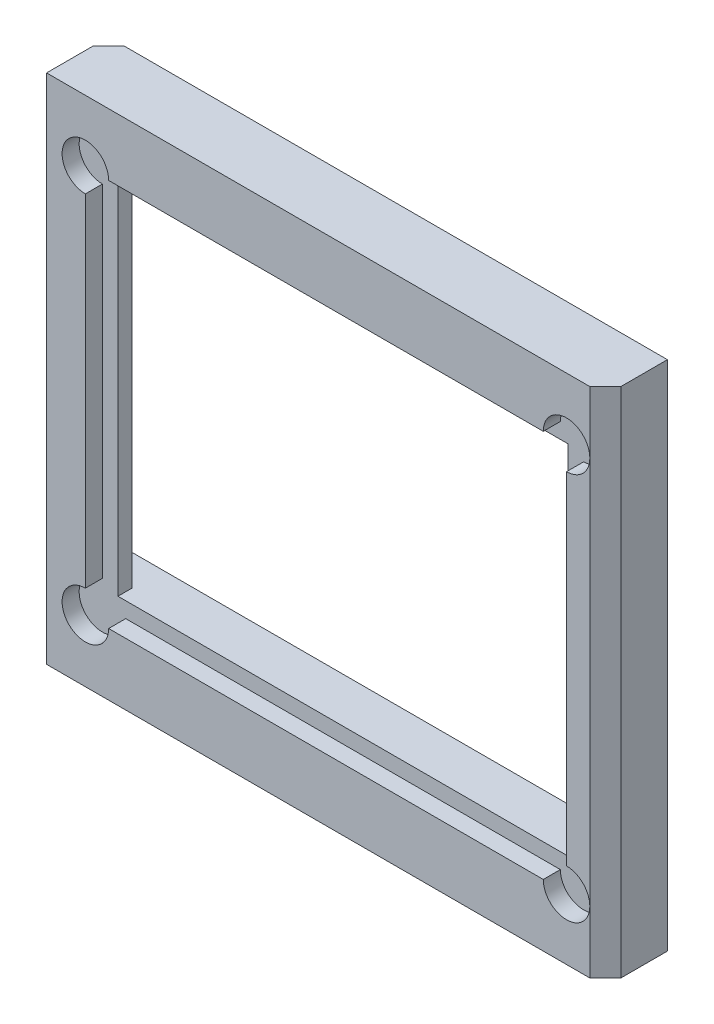
ISO-10303-21;
HEADER;
FILE_DESCRIPTION(('STEP AP214'),'2;1');
FILE_NAME('part.step','',(''),(''),'','','');
FILE_SCHEMA(('AUTOMOTIVE_DESIGN { 1 0 10303 214 1 1 1 1 }'));
ENDSEC;
DATA;
#1=APPLICATION_CONTEXT('core data for automotive mechanical design processes');
#2=APPLICATION_PROTOCOL_DEFINITION('international standard','automotive_design',2000,#1);
#3=PRODUCT_CONTEXT('',#1,'mechanical');
#4=PRODUCT('Part','Part','',(#3));
#5=PRODUCT_RELATED_PRODUCT_CATEGORY('part','',(#4));
#6=PRODUCT_DEFINITION_FORMATION('','',#4);
#7=PRODUCT_DEFINITION_CONTEXT('part definition',#1,'design');
#8=PRODUCT_DEFINITION('design','',#6,#7);
#9=PRODUCT_DEFINITION_SHAPE('','',#8);
#10=(LENGTH_UNIT() NAMED_UNIT(*) SI_UNIT(.MILLI.,.METRE.));
#11=(NAMED_UNIT(*) PLANE_ANGLE_UNIT() SI_UNIT($,.RADIAN.));
#12=(NAMED_UNIT(*) SI_UNIT($,.STERADIAN.) SOLID_ANGLE_UNIT());
#13=UNCERTAINTY_MEASURE_WITH_UNIT(LENGTH_MEASURE(1.E-05),#10,'distance_accuracy_value','');
#14=(GEOMETRIC_REPRESENTATION_CONTEXT(3) GLOBAL_UNCERTAINTY_ASSIGNED_CONTEXT((#13)) GLOBAL_UNIT_ASSIGNED_CONTEXT((#10,
#11,#12)) REPRESENTATION_CONTEXT('',''));
#15=CARTESIAN_POINT('',(0.,0.,0.));
#16=DIRECTION('',(0.,0.,1.));
#17=DIRECTION('',(1.,0.,0.));
#18=AXIS2_PLACEMENT_3D('',#15,#16,#17);
#19=CARTESIAN_POINT('',(0.,0.,4.));
#20=DIRECTION('',(0.,0.,-1.));
#21=DIRECTION('',(-1.,0.,0.));
#22=AXIS2_PLACEMENT_3D('',#19,#20,#21);
#23=PLANE('',#22);
#24=DIRECTION('',(1.,0.,0.));
#25=VECTOR('',#24,1.);
#26=CARTESIAN_POINT('',(-18.,-16.5,4.));
#27=LINE('',#26,#25);
#28=CARTESIAN_POINT('',(-18.,-16.5,4.));
#29=VERTEX_POINT('',#28);
#30=CARTESIAN_POINT('',(17.,-16.5,4.));
#31=VERTEX_POINT('',#30);
#32=EDGE_CURVE('E309',#29,#31,#27,.T.);
#33=ORIENTED_EDGE('',*,*,#32,.T.);
#34=DIRECTION('',(0.,1.,0.));
#35=VECTOR('',#34,1.);
#36=CARTESIAN_POINT('',(17.,0.,4.));
#37=LINE('',#36,#35);
#38=CARTESIAN_POINT('',(17.,-12.5,4.));
#39=VERTEX_POINT('',#38);
#40=EDGE_CURVE('E47',#31,#39,#37,.T.);
#41=ORIENTED_EDGE('',*,*,#40,.T.);
#42=CARTESIAN_POINT('',(15.5,-12.5,4.));
#43=DIRECTION('',(0.,0.,1.));
#44=DIRECTION('',(1.,0.,0.));
#45=AXIS2_PLACEMENT_3D('',#42,#43,#44);
#46=CIRCLE('',#45,1.49999999999999);
#47=CARTESIAN_POINT('',(14.,-12.5,4.));
#48=VERTEX_POINT('',#47);
#49=EDGE_CURVE('E263',#48,#39,#46,.T.);
#50=ORIENTED_EDGE('',*,*,#49,.F.);
#51=DIRECTION('',(1.,0.,0.));
#52=VECTOR('',#51,1.);
#53=CARTESIAN_POINT('',(-15.5,-12.5,4.));
#54=LINE('',#53,#52);
#55=CARTESIAN_POINT('',(-14.,-12.5,4.));
#56=VERTEX_POINT('',#55);
#57=EDGE_CURVE('E286',#56,#48,#54,.T.);
#58=ORIENTED_EDGE('',*,*,#57,.F.);
#59=CARTESIAN_POINT('',(-15.5,-12.5,4.));
#60=DIRECTION('',(0.,0.,1.));
#61=DIRECTION('',(1.,0.,0.));
#62=AXIS2_PLACEMENT_3D('',#59,#60,#61);
#63=CIRCLE('',#62,1.49999999999999);
#64=CARTESIAN_POINT('',(-15.5,-11.,4.));
#65=VERTEX_POINT('',#64);
#66=EDGE_CURVE('E274',#65,#56,#63,.T.);
#67=ORIENTED_EDGE('',*,*,#66,.F.);
#68=DIRECTION('',(0.,-1.,0.));
#69=VECTOR('',#68,1.);
#70=CARTESIAN_POINT('',(-15.5,-12.5,4.));
#71=LINE('',#70,#69);
#72=CARTESIAN_POINT('',(-15.5,11.,4.));
#73=VERTEX_POINT('',#72);
#74=EDGE_CURVE('E300',#73,#65,#71,.T.);
#75=ORIENTED_EDGE('',*,*,#74,.F.);
#76=CARTESIAN_POINT('',(-15.5,12.5,4.));
#77=DIRECTION('',(0.,0.,1.));
#78=DIRECTION('',(1.,0.,0.));
#79=AXIS2_PLACEMENT_3D('',#76,#77,#78);
#80=CIRCLE('',#79,1.49999999999999);
#81=CARTESIAN_POINT('',(-14.,12.5,4.));
#82=VERTEX_POINT('',#81);
#83=EDGE_CURVE('E235',#82,#73,#80,.T.);
#84=ORIENTED_EDGE('',*,*,#83,.F.);
#85=DIRECTION('',(-1.,0.,0.));
#86=VECTOR('',#85,1.);
#87=CARTESIAN_POINT('',(-15.5,12.5,4.));
#88=LINE('',#87,#86);
#89=CARTESIAN_POINT('',(14.,12.5,4.));
#90=VERTEX_POINT('',#89);
#91=EDGE_CURVE('E297',#90,#82,#88,.T.);
#92=ORIENTED_EDGE('',*,*,#91,.F.);
#93=CARTESIAN_POINT('',(15.5,12.5,4.));
#94=DIRECTION('',(0.,0.,1.));
#95=DIRECTION('',(1.,0.,0.));
#96=AXIS2_PLACEMENT_3D('',#93,#94,#95);
#97=CIRCLE('',#96,1.49999999999999);
#98=CARTESIAN_POINT('',(17.,12.5,4.));
#99=VERTEX_POINT('',#98);
#100=EDGE_CURVE('E250',#99,#90,#97,.T.);
#101=ORIENTED_EDGE('',*,*,#100,.F.);
#102=DIRECTION('',(0.,1.,0.));
#103=VECTOR('',#102,1.);
#104=CARTESIAN_POINT('',(17.,0.,4.));
#105=LINE('',#104,#103);
#106=CARTESIAN_POINT('',(17.,16.5,4.));
#107=VERTEX_POINT('',#106);
#108=EDGE_CURVE('E365',#99,#107,#105,.T.);
#109=ORIENTED_EDGE('',*,*,#108,.T.);
#110=DIRECTION('',(-1.,0.,0.));
#111=VECTOR('',#110,1.);
#112=CARTESIAN_POINT('',(-18.,16.5,4.));
#113=LINE('',#112,#111);
#114=CARTESIAN_POINT('',(-18.,16.5,4.));
#115=VERTEX_POINT('',#114);
#116=EDGE_CURVE('E304',#107,#115,#113,.T.);
#117=ORIENTED_EDGE('',*,*,#116,.T.);
#118=DIRECTION('',(0.,-1.,0.));
#119=VECTOR('',#118,1.);
#120=CARTESIAN_POINT('',(-18.,-16.5,4.));
#121=LINE('',#120,#119);
#122=EDGE_CURVE('E306',#115,#29,#121,.T.);
#123=ORIENTED_EDGE('',*,*,#122,.T.);
#124=EDGE_LOOP('',(#33,#41,#50,#58,#67,#75,#84,#92,#101,#109,#117,#123));
#125=FACE_BOUND('',#124,.T.);
#126=ADVANCED_FACE('F38',(#125),#23,.F.);
#127=CARTESIAN_POINT('',(0.,0.,2.9));
#128=DIRECTION('',(0.,0.,-1.));
#129=DIRECTION('',(-1.,0.,0.));
#130=AXIS2_PLACEMENT_3D('',#127,#128,#129);
#131=PLANE('',#130);
#132=DIRECTION('',(-1.,0.,0.));
#133=VECTOR('',#132,1.);
#134=CARTESIAN_POINT('',(-15.5,12.5,2.9));
#135=LINE('',#134,#133);
#136=CARTESIAN_POINT('',(14.,12.5,2.9));
#137=VERTEX_POINT('',#136);
#138=CARTESIAN_POINT('',(-14.,12.5,2.9));
#139=VERTEX_POINT('',#138);
#140=EDGE_CURVE('E285',#137,#139,#135,.T.);
#141=ORIENTED_EDGE('',*,*,#140,.T.);
#142=CARTESIAN_POINT('',(-15.5,12.5,2.9));
#143=DIRECTION('',(0.,0.,1.));
#144=DIRECTION('',(1.,0.,0.));
#145=AXIS2_PLACEMENT_3D('',#142,#143,#144);
#146=CIRCLE('',#145,1.5);
#147=CARTESIAN_POINT('',(-15.5,11.,2.9));
#148=VERTEX_POINT('',#147);
#149=EDGE_CURVE('E242',#139,#148,#146,.T.);
#150=ORIENTED_EDGE('',*,*,#149,.T.);
#151=DIRECTION('',(0.,-1.,0.));
#152=VECTOR('',#151,1.);
#153=CARTESIAN_POINT('',(-15.5,-12.5,2.9));
#154=LINE('',#153,#152);
#155=CARTESIAN_POINT('',(-15.5,-11.,2.9));
#156=VERTEX_POINT('',#155);
#157=EDGE_CURVE('E289',#148,#156,#154,.T.);
#158=ORIENTED_EDGE('',*,*,#157,.T.);
#159=CARTESIAN_POINT('',(-15.5,-12.5,2.9));
#160=DIRECTION('',(0.,0.,1.));
#161=DIRECTION('',(1.,0.,0.));
#162=AXIS2_PLACEMENT_3D('',#159,#160,#161);
#163=CIRCLE('',#162,1.5);
#164=CARTESIAN_POINT('',(-14.,-12.5,2.9));
#165=VERTEX_POINT('',#164);
#166=EDGE_CURVE('E276',#156,#165,#163,.T.);
#167=ORIENTED_EDGE('',*,*,#166,.T.);
#168=DIRECTION('',(1.,0.,0.));
#169=VECTOR('',#168,1.);
#170=CARTESIAN_POINT('',(-15.5,-12.5,2.9));
#171=LINE('',#170,#169);
#172=CARTESIAN_POINT('',(14.,-12.5,2.9));
#173=VERTEX_POINT('',#172);
#174=EDGE_CURVE('E291',#165,#173,#171,.T.);
#175=ORIENTED_EDGE('',*,*,#174,.T.);
#176=CARTESIAN_POINT('',(15.5,-12.5,2.9));
#177=DIRECTION('',(0.,0.,1.));
#178=DIRECTION('',(1.,0.,0.));
#179=AXIS2_PLACEMENT_3D('',#176,#177,#178);
#180=CIRCLE('',#179,1.5);
#181=CARTESIAN_POINT('',(15.5,-11.,2.9));
#182=VERTEX_POINT('',#181);
#183=EDGE_CURVE('E266',#173,#182,#180,.T.);
#184=ORIENTED_EDGE('',*,*,#183,.T.);
#185=DIRECTION('',(0.,1.,0.));
#186=VECTOR('',#185,1.);
#187=CARTESIAN_POINT('',(15.5,-12.5,2.9));
#188=LINE('',#187,#186);
#189=CARTESIAN_POINT('',(15.5,11.,2.9));
#190=VERTEX_POINT('',#189);
#191=EDGE_CURVE('E282',#182,#190,#188,.T.);
#192=ORIENTED_EDGE('',*,*,#191,.T.);
#193=CARTESIAN_POINT('',(15.5,12.5,2.9));
#194=DIRECTION('',(0.,0.,1.));
#195=DIRECTION('',(1.,0.,0.));
#196=AXIS2_PLACEMENT_3D('',#193,#194,#195);
#197=CIRCLE('',#196,1.5);
#198=EDGE_CURVE('E254',#190,#137,#197,.T.);
#199=ORIENTED_EDGE('',*,*,#198,.T.);
#200=EDGE_LOOP('',(#141,#150,#158,#167,#175,#184,#192,#199));
#201=FACE_BOUND('',#200,.T.);
#202=DIRECTION('',(0.,1.,0.));
#203=VECTOR('',#202,1.);
#204=CARTESIAN_POINT('',(14.5,-11.5,2.9));
#205=LINE('',#204,#203);
#206=CARTESIAN_POINT('',(14.5,-11.5,2.9));
#207=VERTEX_POINT('',#206);
#208=CARTESIAN_POINT('',(14.5,11.5,2.9));
#209=VERTEX_POINT('',#208);
#210=EDGE_CURVE('E216',#207,#209,#205,.T.);
#211=ORIENTED_EDGE('',*,*,#210,.F.);
#212=DIRECTION('',(1.,0.,0.));
#213=VECTOR('',#212,1.);
#214=CARTESIAN_POINT('',(-14.5,-11.5,2.9));
#215=LINE('',#214,#213);
#216=CARTESIAN_POINT('',(-14.5,-11.5,2.9));
#217=VERTEX_POINT('',#216);
#218=EDGE_CURVE('E220',#217,#207,#215,.T.);
#219=ORIENTED_EDGE('',*,*,#218,.F.);
#220=DIRECTION('',(0.,-1.,0.));
#221=VECTOR('',#220,1.);
#222=CARTESIAN_POINT('',(-14.5,-11.5,2.9));
#223=LINE('',#222,#221);
#224=CARTESIAN_POINT('',(-14.5,11.5,2.9));
#225=VERTEX_POINT('',#224);
#226=EDGE_CURVE('E228',#225,#217,#223,.T.);
#227=ORIENTED_EDGE('',*,*,#226,.F.);
#228=DIRECTION('',(-1.,0.,0.));
#229=VECTOR('',#228,1.);
#230=CARTESIAN_POINT('',(-14.5,11.5,2.9));
#231=LINE('',#230,#229);
#232=EDGE_CURVE('E225',#209,#225,#231,.T.);
#233=ORIENTED_EDGE('',*,*,#232,.F.);
#234=EDGE_LOOP('',(#211,#219,#227,#233));
#235=FACE_BOUND('',#234,.T.);
#236=ADVANCED_FACE('F381',(#201,#235),#131,.F.);
#237=CARTESIAN_POINT('',(15.5,-11.,4.));
#238=VERTEX_POINT('',#237);
#239=EDGE_CURVE('E262',#39,#238,#46,.T.);
#240=ORIENTED_EDGE('',*,*,#239,.F.);
#241=DIRECTION('',(0.,1.,0.));
#242=VECTOR('',#241,1.);
#243=CARTESIAN_POINT('',(17.,0.,4.));
#244=LINE('',#243,#242);
#245=EDGE_CURVE('E54',#39,#99,#244,.T.);
#246=ORIENTED_EDGE('',*,*,#245,.T.);
#247=CARTESIAN_POINT('',(15.5,11.,4.));
#248=VERTEX_POINT('',#247);
#249=EDGE_CURVE('E251',#248,#99,#97,.T.);
#250=ORIENTED_EDGE('',*,*,#249,.F.);
#251=DIRECTION('',(0.,1.,0.));
#252=VECTOR('',#251,1.);
#253=CARTESIAN_POINT('',(15.5,-12.5,4.));
#254=LINE('',#253,#252);
#255=EDGE_CURVE('E281',#238,#248,#254,.T.);
#256=ORIENTED_EDGE('',*,*,#255,.F.);
#257=EDGE_LOOP('',(#240,#246,#250,#256));
#258=FACE_BOUND('',#257,.T.);
#259=ADVANCED_FACE('F373',(#258),#23,.F.);
#260=CARTESIAN_POINT('',(18.,-16.5,4.));
#261=DIRECTION('',(-1.,0.,0.));
#262=DIRECTION('',(0.,0.,1.));
#263=AXIS2_PLACEMENT_3D('',#260,#261,#262);
#264=PLANE('',#263);
#265=DIRECTION('',(0.,0.,-1.));
#266=VECTOR('',#265,1.);
#267=CARTESIAN_POINT('',(18.,16.5,4.));
#268=LINE('',#267,#266);
#269=CARTESIAN_POINT('',(18.,16.5,3.));
#270=VERTEX_POINT('',#269);
#271=CARTESIAN_POINT('',(18.,16.5,0.));
#272=VERTEX_POINT('',#271);
#273=EDGE_CURVE('E327',#270,#272,#268,.T.);
#274=ORIENTED_EDGE('',*,*,#273,.F.);
#275=DIRECTION('',(0.,-1.,0.));
#276=VECTOR('',#275,1.);
#277=CARTESIAN_POINT('',(18.,-16.5,3.));
#278=LINE('',#277,#276);
#279=CARTESIAN_POINT('',(18.,-16.5,3.));
#280=VERTEX_POINT('',#279);
#281=EDGE_CURVE('E11',#270,#280,#278,.T.);
#282=ORIENTED_EDGE('',*,*,#281,.T.);
#283=DIRECTION('',(0.,0.,-1.));
#284=VECTOR('',#283,1.);
#285=CARTESIAN_POINT('',(18.,-16.5,4.));
#286=LINE('',#285,#284);
#287=CARTESIAN_POINT('',(18.,-16.5,0.));
#288=VERTEX_POINT('',#287);
#289=EDGE_CURVE('E312',#280,#288,#286,.T.);
#290=ORIENTED_EDGE('',*,*,#289,.T.);
#291=DIRECTION('',(0.,1.,0.));
#292=VECTOR('',#291,1.);
#293=CARTESIAN_POINT('',(18.,-16.5,0.));
#294=LINE('',#293,#292);
#295=EDGE_CURVE('E294',#288,#272,#294,.T.);
#296=ORIENTED_EDGE('',*,*,#295,.T.);
#297=EDGE_LOOP('',(#274,#282,#290,#296));
#298=FACE_BOUND('',#297,.T.);
#299=ADVANCED_FACE('F414',(#298),#264,.F.);
#300=CARTESIAN_POINT('',(-18.,16.5,4.));
#301=DIRECTION('',(0.,-1.,0.));
#302=DIRECTION('',(0.,0.,-1.));
#303=AXIS2_PLACEMENT_3D('',#300,#301,#302);
#304=PLANE('',#303);
#305=DIRECTION('',(-1.,0.,0.));
#306=VECTOR('',#305,1.);
#307=CARTESIAN_POINT('',(-18.,16.5,0.));
#308=LINE('',#307,#306);
#309=CARTESIAN_POINT('',(-17.,16.5,0.));
#310=VERTEX_POINT('',#309);
#311=EDGE_CURVE('E315',#272,#310,#308,.T.);
#312=ORIENTED_EDGE('',*,*,#311,.T.);
#313=DIRECTION('',(-0.70710678118655,0.,0.707106781186545));
#314=VECTOR('',#313,1.);
#315=CARTESIAN_POINT('',(-18.,16.5,1.));
#316=LINE('',#315,#314);
#317=CARTESIAN_POINT('',(-18.,16.5,1.));
#318=VERTEX_POINT('',#317);
#319=EDGE_CURVE('E363',#310,#318,#316,.T.);
#320=ORIENTED_EDGE('',*,*,#319,.T.);
#321=DIRECTION('',(0.,0.,-1.));
#322=VECTOR('',#321,1.);
#323=CARTESIAN_POINT('',(-18.,16.5,4.));
#324=LINE('',#323,#322);
#325=EDGE_CURVE('E324',#115,#318,#324,.T.);
#326=ORIENTED_EDGE('',*,*,#325,.F.);
#327=ORIENTED_EDGE('',*,*,#116,.F.);
#328=DIRECTION('',(-0.707106781186545,0.,0.70710678118655));
#329=VECTOR('',#328,1.);
#330=CARTESIAN_POINT('',(17.,16.5,4.));
#331=LINE('',#330,#329);
#332=EDGE_CURVE('E361',#107,#270,#331,.F.);
#333=ORIENTED_EDGE('',*,*,#332,.T.);
#334=ORIENTED_EDGE('',*,*,#273,.T.);
#335=EDGE_LOOP('',(#312,#320,#326,#327,#333,#334));
#336=FACE_BOUND('',#335,.T.);
#337=ADVANCED_FACE('F410',(#336),#304,.F.);
#338=CARTESIAN_POINT('',(-18.,-16.5,4.));
#339=DIRECTION('',(1.,0.,0.));
#340=DIRECTION('',(0.,0.,-1.));
#341=AXIS2_PLACEMENT_3D('',#338,#339,#340);
#342=PLANE('',#341);
#343=ORIENTED_EDGE('',*,*,#325,.T.);
#344=DIRECTION('',(0.,-1.,0.));
#345=VECTOR('',#344,1.);
#346=CARTESIAN_POINT('',(-18.,-16.5,1.));
#347=LINE('',#346,#345);
#348=CARTESIAN_POINT('',(-18.,-16.5,1.));
#349=VERTEX_POINT('',#348);
#350=EDGE_CURVE('E352',#318,#349,#347,.T.);
#351=ORIENTED_EDGE('',*,*,#350,.T.);
#352=DIRECTION('',(0.,0.,-1.));
#353=VECTOR('',#352,1.);
#354=CARTESIAN_POINT('',(-18.,-16.5,4.));
#355=LINE('',#354,#353);
#356=EDGE_CURVE('E321',#29,#349,#355,.T.);
#357=ORIENTED_EDGE('',*,*,#356,.F.);
#358=ORIENTED_EDGE('',*,*,#122,.F.);
#359=EDGE_LOOP('',(#343,#351,#357,#358));
#360=FACE_BOUND('',#359,.T.);
#361=ADVANCED_FACE('F427',(#360),#342,.F.);
#362=CARTESIAN_POINT('',(-18.,-16.5,4.));
#363=DIRECTION('',(0.,1.,0.));
#364=DIRECTION('',(0.,0.,1.));
#365=AXIS2_PLACEMENT_3D('',#362,#363,#364);
#366=PLANE('',#365);
#367=CARTESIAN_POINT('',(0.,-16.5,1.95141063670081));
#368=DIRECTION('',(0.,-1.,0.));
#369=DIRECTION('',(0.,0.,-1.));
#370=AXIS2_PLACEMENT_3D('',#367,#368,#369);
#371=CIRCLE('',#370,1.025);
#372=CARTESIAN_POINT('',(0.,-16.5,0.926410636700812));
#373=VERTEX_POINT('',#372);
#374=EDGE_CURVE('E200',#373,#373,#371,.T.);
#375=ORIENTED_EDGE('',*,*,#374,.F.);
#376=EDGE_LOOP('',(#375));
#377=FACE_BOUND('',#376,.T.);
#378=CARTESIAN_POINT('',(-12.5,-16.5,2.));
#379=DIRECTION('',(0.,-1.,0.));
#380=DIRECTION('',(0.,0.,-1.));
#381=AXIS2_PLACEMENT_3D('',#378,#379,#380);
#382=CIRCLE('',#381,1.49999999999999);
#383=CARTESIAN_POINT('',(-12.5,-16.5,0.500000000000011));
#384=VERTEX_POINT('',#383);
#385=EDGE_CURVE('E199',#384,#384,#382,.T.);
#386=ORIENTED_EDGE('',*,*,#385,.F.);
#387=EDGE_LOOP('',(#386));
#388=FACE_BOUND('',#387,.T.);
#389=CARTESIAN_POINT('',(12.5,-16.5,2.));
#390=DIRECTION('',(0.,-1.,0.));
#391=DIRECTION('',(0.,0.,-1.));
#392=AXIS2_PLACEMENT_3D('',#389,#390,#391);
#393=CIRCLE('',#392,1.49999999999999);
#394=CARTESIAN_POINT('',(12.5,-16.5,0.500000000000011));
#395=VERTEX_POINT('',#394);
#396=EDGE_CURVE('E210',#395,#395,#393,.T.);
#397=ORIENTED_EDGE('',*,*,#396,.F.);
#398=EDGE_LOOP('',(#397));
#399=FACE_BOUND('',#398,.T.);
#400=ORIENTED_EDGE('',*,*,#356,.T.);
#401=DIRECTION('',(0.70710678118655,0.,-0.707106781186545));
#402=VECTOR('',#401,1.);
#403=CARTESIAN_POINT('',(-18.,-16.5,1.));
#404=LINE('',#403,#402);
#405=CARTESIAN_POINT('',(-17.,-16.5,0.));
#406=VERTEX_POINT('',#405);
#407=EDGE_CURVE('E357',#349,#406,#404,.T.);
#408=ORIENTED_EDGE('',*,*,#407,.T.);
#409=DIRECTION('',(1.,0.,0.));
#410=VECTOR('',#409,1.);
#411=CARTESIAN_POINT('',(-18.,-16.5,0.));
#412=LINE('',#411,#410);
#413=EDGE_CURVE('E307',#406,#288,#412,.T.);
#414=ORIENTED_EDGE('',*,*,#413,.T.);
#415=ORIENTED_EDGE('',*,*,#289,.F.);
#416=DIRECTION('',(0.707106781186545,0.,-0.70710678118655));
#417=VECTOR('',#416,1.);
#418=CARTESIAN_POINT('',(17.,-16.5,4.));
#419=LINE('',#418,#417);
#420=EDGE_CURVE('E355',#280,#31,#419,.F.);
#421=ORIENTED_EDGE('',*,*,#420,.T.);
#422=ORIENTED_EDGE('',*,*,#32,.F.);
#423=EDGE_LOOP('',(#400,#408,#414,#415,#421,#422));
#424=FACE_BOUND('',#423,.T.);
#425=ADVANCED_FACE('F430',(#377,#388,#399,#424),#366,.F.);
#426=CARTESIAN_POINT('',(0.,0.,0.));
#427=DIRECTION('',(0.,0.,-1.));
#428=DIRECTION('',(-1.,0.,0.));
#429=AXIS2_PLACEMENT_3D('',#426,#427,#428);
#430=PLANE('',#429);
#431=DIRECTION('',(0.,-1.,0.));
#432=VECTOR('',#431,1.);
#433=CARTESIAN_POINT('',(-16.5,-11.5,0.));
#434=LINE('',#433,#432);
#435=CARTESIAN_POINT('',(-16.5,11.5,0.));
#436=VERTEX_POINT('',#435);
#437=CARTESIAN_POINT('',(-16.5,-11.5,0.));
#438=VERTEX_POINT('',#437);
#439=EDGE_CURVE('E335',#436,#438,#434,.T.);
#440=ORIENTED_EDGE('',*,*,#439,.T.);
#441=DIRECTION('',(1.,0.,0.));
#442=VECTOR('',#441,1.);
#443=CARTESIAN_POINT('',(-14.5,-11.5,0.));
#444=LINE('',#443,#442);
#445=CARTESIAN_POINT('',(16.5,-11.5,0.));
#446=VERTEX_POINT('',#445);
#447=EDGE_CURVE('E219',#438,#446,#444,.T.);
#448=ORIENTED_EDGE('',*,*,#447,.T.);
#449=DIRECTION('',(0.,1.,0.));
#450=VECTOR('',#449,1.);
#451=CARTESIAN_POINT('',(16.5,11.5,0.));
#452=LINE('',#451,#450);
#453=CARTESIAN_POINT('',(16.5,11.5,0.));
#454=VERTEX_POINT('',#453);
#455=EDGE_CURVE('E332',#446,#454,#452,.T.);
#456=ORIENTED_EDGE('',*,*,#455,.T.);
#457=DIRECTION('',(-1.,0.,0.));
#458=VECTOR('',#457,1.);
#459=CARTESIAN_POINT('',(-14.5,11.5,0.));
#460=LINE('',#459,#458);
#461=EDGE_CURVE('E217',#454,#436,#460,.T.);
#462=ORIENTED_EDGE('',*,*,#461,.T.);
#463=EDGE_LOOP('',(#440,#448,#456,#462));
#464=FACE_BOUND('',#463,.T.);
#465=ORIENTED_EDGE('',*,*,#413,.F.);
#466=DIRECTION('',(0.,1.,0.));
#467=VECTOR('',#466,1.);
#468=CARTESIAN_POINT('',(-17.,16.5,0.));
#469=LINE('',#468,#467);
#470=EDGE_CURVE('E359',#406,#310,#469,.T.);
#471=ORIENTED_EDGE('',*,*,#470,.T.);
#472=ORIENTED_EDGE('',*,*,#311,.F.);
#473=ORIENTED_EDGE('',*,*,#295,.F.);
#474=EDGE_LOOP('',(#465,#471,#472,#473));
#475=FACE_BOUND('',#474,.T.);
#476=ADVANCED_FACE('F419',(#464,#475),#430,.T.);
#477=CARTESIAN_POINT('',(15.5,-12.5,2.9));
#478=DIRECTION('',(1.,0.,0.));
#479=DIRECTION('',(0.,0.,-1.));
#480=AXIS2_PLACEMENT_3D('',#477,#478,#479);
#481=PLANE('',#480);
#482=ORIENTED_EDGE('',*,*,#255,.T.);
#483=DIRECTION('',(0.,0.,1.));
#484=VECTOR('',#483,1.);
#485=CARTESIAN_POINT('',(15.5,11.,4.));
#486=LINE('',#485,#484);
#487=EDGE_CURVE('E259',#248,#190,#486,.F.);
#488=ORIENTED_EDGE('',*,*,#487,.T.);
#489=ORIENTED_EDGE('',*,*,#191,.F.);
#490=DIRECTION('',(0.,0.,1.));
#491=VECTOR('',#490,1.);
#492=CARTESIAN_POINT('',(15.5,-11.,4.));
#493=LINE('',#492,#491);
#494=EDGE_CURVE('E271',#182,#238,#493,.T.);
#495=ORIENTED_EDGE('',*,*,#494,.T.);
#496=EDGE_LOOP('',(#482,#488,#489,#495));
#497=FACE_BOUND('',#496,.T.);
#498=ADVANCED_FACE('F438',(#497),#481,.F.);
#499=CARTESIAN_POINT('',(-15.5,-12.5,2.9));
#500=DIRECTION('',(0.,-1.,0.));
#501=DIRECTION('',(0.,0.,-1.));
#502=AXIS2_PLACEMENT_3D('',#499,#500,#501);
#503=PLANE('',#502);
#504=ORIENTED_EDGE('',*,*,#57,.T.);
#505=DIRECTION('',(0.,0.,1.));
#506=VECTOR('',#505,1.);
#507=CARTESIAN_POINT('',(14.,-12.5,4.));
#508=LINE('',#507,#506);
#509=EDGE_CURVE('E268',#48,#173,#508,.F.);
#510=ORIENTED_EDGE('',*,*,#509,.T.);
#511=ORIENTED_EDGE('',*,*,#174,.F.);
#512=DIRECTION('',(0.,0.,1.));
#513=VECTOR('',#512,1.);
#514=CARTESIAN_POINT('',(-14.,-12.5,4.));
#515=LINE('',#514,#513);
#516=EDGE_CURVE('E329',#165,#56,#515,.T.);
#517=ORIENTED_EDGE('',*,*,#516,.T.);
#518=EDGE_LOOP('',(#504,#510,#511,#517));
#519=FACE_BOUND('',#518,.T.);
#520=ADVANCED_FACE('F379',(#519),#503,.F.);
#521=CARTESIAN_POINT('',(-15.5,-12.5,2.9));
#522=DIRECTION('',(-1.,0.,0.));
#523=DIRECTION('',(0.,0.,1.));
#524=AXIS2_PLACEMENT_3D('',#521,#522,#523);
#525=PLANE('',#524);
#526=ORIENTED_EDGE('',*,*,#157,.F.);
#527=DIRECTION('',(0.,0.,1.));
#528=VECTOR('',#527,1.);
#529=CARTESIAN_POINT('',(-15.5,11.,4.));
#530=LINE('',#529,#528);
#531=EDGE_CURVE('E244',#148,#73,#530,.T.);
#532=ORIENTED_EDGE('',*,*,#531,.T.);
#533=ORIENTED_EDGE('',*,*,#74,.T.);
#534=DIRECTION('',(0.,0.,1.));
#535=VECTOR('',#534,1.);
#536=CARTESIAN_POINT('',(-15.5,-11.,4.));
#537=LINE('',#536,#535);
#538=EDGE_CURVE('E278',#65,#156,#537,.F.);
#539=ORIENTED_EDGE('',*,*,#538,.T.);
#540=EDGE_LOOP('',(#526,#532,#533,#539));
#541=FACE_BOUND('',#540,.T.);
#542=ADVANCED_FACE('F394',(#541),#525,.F.);
#543=CARTESIAN_POINT('',(-15.5,12.5,2.9));
#544=DIRECTION('',(0.,1.,0.));
#545=DIRECTION('',(0.,0.,1.));
#546=AXIS2_PLACEMENT_3D('',#543,#544,#545);
#547=PLANE('',#546);
#548=ORIENTED_EDGE('',*,*,#91,.T.);
#549=DIRECTION('',(0.,0.,1.));
#550=VECTOR('',#549,1.);
#551=CARTESIAN_POINT('',(-14.,12.5,4.));
#552=LINE('',#551,#550);
#553=EDGE_CURVE('E247',#82,#139,#552,.F.);
#554=ORIENTED_EDGE('',*,*,#553,.T.);
#555=ORIENTED_EDGE('',*,*,#140,.F.);
#556=DIRECTION('',(0.,0.,1.));
#557=VECTOR('',#556,1.);
#558=CARTESIAN_POINT('',(14.,12.5,4.));
#559=LINE('',#558,#557);
#560=EDGE_CURVE('E256',#137,#90,#559,.T.);
#561=ORIENTED_EDGE('',*,*,#560,.T.);
#562=EDGE_LOOP('',(#548,#554,#555,#561));
#563=FACE_BOUND('',#562,.T.);
#564=ADVANCED_FACE('F400',(#563),#547,.F.);
#565=CARTESIAN_POINT('',(-15.5,-12.5,4.));
#566=DIRECTION('',(0.,0.,1.));
#567=DIRECTION('',(1.,0.,0.));
#568=AXIS2_PLACEMENT_3D('',#565,#566,#567);
#569=CYLINDRICAL_SURFACE('',#568,1.49999999999999);
#570=ORIENTED_EDGE('',*,*,#66,.T.);
#571=ORIENTED_EDGE('',*,*,#516,.F.);
#572=ORIENTED_EDGE('',*,*,#166,.F.);
#573=ORIENTED_EDGE('',*,*,#538,.F.);
#574=EDGE_LOOP('',(#570,#571,#572,#573));
#575=FACE_BOUND('',#574,.T.);
#576=ADVANCED_FACE('F388',(#575),#569,.F.);
#577=CARTESIAN_POINT('',(15.5,-12.5,4.));
#578=DIRECTION('',(0.,0.,1.));
#579=DIRECTION('',(1.,0.,0.));
#580=AXIS2_PLACEMENT_3D('',#577,#578,#579);
#581=CYLINDRICAL_SURFACE('',#580,1.49999999999999);
#582=ORIENTED_EDGE('',*,*,#183,.F.);
#583=ORIENTED_EDGE('',*,*,#509,.F.);
#584=ORIENTED_EDGE('',*,*,#49,.T.);
#585=ORIENTED_EDGE('',*,*,#239,.T.);
#586=ORIENTED_EDGE('',*,*,#494,.F.);
#587=EDGE_LOOP('',(#582,#583,#584,#585,#586));
#588=FACE_BOUND('',#587,.T.);
#589=ADVANCED_FACE('F376',(#588),#581,.F.);
#590=CARTESIAN_POINT('',(15.5,12.5,4.));
#591=DIRECTION('',(0.,0.,1.));
#592=DIRECTION('',(1.,0.,0.));
#593=AXIS2_PLACEMENT_3D('',#590,#591,#592);
#594=CYLINDRICAL_SURFACE('',#593,1.49999999999999);
#595=ORIENTED_EDGE('',*,*,#249,.T.);
#596=ORIENTED_EDGE('',*,*,#100,.T.);
#597=ORIENTED_EDGE('',*,*,#560,.F.);
#598=ORIENTED_EDGE('',*,*,#198,.F.);
#599=ORIENTED_EDGE('',*,*,#487,.F.);
#600=EDGE_LOOP('',(#595,#596,#597,#598,#599));
#601=FACE_BOUND('',#600,.T.);
#602=ADVANCED_FACE('F404',(#601),#594,.F.);
#603=CARTESIAN_POINT('',(-15.5,12.5,4.));
#604=DIRECTION('',(0.,0.,1.));
#605=DIRECTION('',(1.,0.,0.));
#606=AXIS2_PLACEMENT_3D('',#603,#604,#605);
#607=CYLINDRICAL_SURFACE('',#606,1.49999999999999);
#608=ORIENTED_EDGE('',*,*,#83,.T.);
#609=ORIENTED_EDGE('',*,*,#531,.F.);
#610=ORIENTED_EDGE('',*,*,#149,.F.);
#611=ORIENTED_EDGE('',*,*,#553,.F.);
#612=EDGE_LOOP('',(#608,#609,#610,#611));
#613=FACE_BOUND('',#612,.T.);
#614=ADVANCED_FACE('F397',(#613),#607,.F.);
#615=CARTESIAN_POINT('',(14.5,-11.5,0.));
#616=DIRECTION('',(1.,0.,0.));
#617=DIRECTION('',(0.,0.,-1.));
#618=AXIS2_PLACEMENT_3D('',#615,#616,#617);
#619=PLANE('',#618);
#620=DIRECTION('',(0.,0.,1.));
#621=VECTOR('',#620,1.);
#622=CARTESIAN_POINT('',(14.5,11.5,0.));
#623=LINE('',#622,#621);
#624=CARTESIAN_POINT('',(14.5,11.5,2.00000000000001));
#625=VERTEX_POINT('',#624);
#626=EDGE_CURVE('E222',#625,#209,#623,.T.);
#627=ORIENTED_EDGE('',*,*,#626,.F.);
#628=DIRECTION('',(0.,-1.,0.));
#629=VECTOR('',#628,1.);
#630=CARTESIAN_POINT('',(14.5,-11.5,2.00000000000001));
#631=LINE('',#630,#629);
#632=CARTESIAN_POINT('',(14.5,-11.5,2.00000000000001));
#633=VERTEX_POINT('',#632);
#634=EDGE_CURVE('E340',#625,#633,#631,.T.);
#635=ORIENTED_EDGE('',*,*,#634,.T.);
#636=DIRECTION('',(0.,0.,1.));
#637=VECTOR('',#636,1.);
#638=CARTESIAN_POINT('',(14.5,-11.5,0.));
#639=LINE('',#638,#637);
#640=EDGE_CURVE('E233',#633,#207,#639,.T.);
#641=ORIENTED_EDGE('',*,*,#640,.T.);
#642=ORIENTED_EDGE('',*,*,#210,.T.);
#643=EDGE_LOOP('',(#627,#635,#641,#642));
#644=FACE_BOUND('',#643,.T.);
#645=ADVANCED_FACE('F502',(#644),#619,.F.);
#646=CARTESIAN_POINT('',(-14.5,-11.5,0.));
#647=DIRECTION('',(0.,-1.,0.));
#648=DIRECTION('',(0.,0.,-1.));
#649=AXIS2_PLACEMENT_3D('',#646,#647,#648);
#650=PLANE('',#649);
#651=ORIENTED_EDGE('',*,*,#218,.T.);
#652=ORIENTED_EDGE('',*,*,#640,.F.);
#653=DIRECTION('',(0.707106781186546,0.,-0.707106781186549));
#654=VECTOR('',#653,1.);
#655=CARTESIAN_POINT('',(1.00000000000006,-11.5,15.5));
#656=LINE('',#655,#654);
#657=EDGE_CURVE('E349',#633,#446,#656,.T.);
#658=ORIENTED_EDGE('',*,*,#657,.T.);
#659=ORIENTED_EDGE('',*,*,#447,.F.);
#660=DIRECTION('',(0.707106781186546,0.,0.707106781186549));
#661=VECTOR('',#660,1.);
#662=CARTESIAN_POINT('',(-15.5,-11.5,1.));
#663=LINE('',#662,#661);
#664=CARTESIAN_POINT('',(-14.5,-11.5,2.00000000000001));
#665=VERTEX_POINT('',#664);
#666=EDGE_CURVE('E342',#438,#665,#663,.T.);
#667=ORIENTED_EDGE('',*,*,#666,.T.);
#668=DIRECTION('',(0.,0.,1.));
#669=VECTOR('',#668,1.);
#670=CARTESIAN_POINT('',(-14.5,-11.5,0.));
#671=LINE('',#670,#669);
#672=EDGE_CURVE('E236',#665,#217,#671,.T.);
#673=ORIENTED_EDGE('',*,*,#672,.T.);
#674=EDGE_LOOP('',(#651,#652,#658,#659,#667,#673));
#675=FACE_BOUND('',#674,.T.);
#676=ADVANCED_FACE('F498',(#675),#650,.F.);
#677=CARTESIAN_POINT('',(-14.5,-11.5,0.));
#678=DIRECTION('',(-1.,0.,0.));
#679=DIRECTION('',(0.,0.,1.));
#680=AXIS2_PLACEMENT_3D('',#677,#678,#679);
#681=PLANE('',#680);
#682=ORIENTED_EDGE('',*,*,#672,.F.);
#683=DIRECTION('',(0.,1.,0.));
#684=VECTOR('',#683,1.);
#685=CARTESIAN_POINT('',(-14.5,11.5,2.00000000000001));
#686=LINE('',#685,#684);
#687=CARTESIAN_POINT('',(-14.5,11.5,2.00000000000001));
#688=VERTEX_POINT('',#687);
#689=EDGE_CURVE('E338',#665,#688,#686,.T.);
#690=ORIENTED_EDGE('',*,*,#689,.T.);
#691=DIRECTION('',(0.,0.,1.));
#692=VECTOR('',#691,1.);
#693=CARTESIAN_POINT('',(-14.5,11.5,0.));
#694=LINE('',#693,#692);
#695=EDGE_CURVE('E238',#688,#225,#694,.T.);
#696=ORIENTED_EDGE('',*,*,#695,.T.);
#697=ORIENTED_EDGE('',*,*,#226,.T.);
#698=EDGE_LOOP('',(#682,#690,#696,#697));
#699=FACE_BOUND('',#698,.T.);
#700=ADVANCED_FACE('F501',(#699),#681,.F.);
#701=CARTESIAN_POINT('',(-14.5,11.5,0.));
#702=DIRECTION('',(0.,1.,0.));
#703=DIRECTION('',(0.,0.,1.));
#704=AXIS2_PLACEMENT_3D('',#701,#702,#703);
#705=PLANE('',#704);
#706=ORIENTED_EDGE('',*,*,#232,.T.);
#707=ORIENTED_EDGE('',*,*,#695,.F.);
#708=DIRECTION('',(-0.707106781186546,0.,-0.707106781186549));
#709=VECTOR('',#708,1.);
#710=CARTESIAN_POINT('',(-15.5,11.5,1.));
#711=LINE('',#710,#709);
#712=EDGE_CURVE('E344',#688,#436,#711,.T.);
#713=ORIENTED_EDGE('',*,*,#712,.T.);
#714=ORIENTED_EDGE('',*,*,#461,.F.);
#715=DIRECTION('',(-0.707106781186546,0.,0.707106781186549));
#716=VECTOR('',#715,1.);
#717=CARTESIAN_POINT('',(1.00000000000006,11.5,15.5));
#718=LINE('',#717,#716);
#719=EDGE_CURVE('E347',#454,#625,#718,.T.);
#720=ORIENTED_EDGE('',*,*,#719,.T.);
#721=ORIENTED_EDGE('',*,*,#626,.T.);
#722=EDGE_LOOP('',(#706,#707,#713,#714,#720,#721));
#723=FACE_BOUND('',#722,.T.);
#724=ADVANCED_FACE('F469',(#723),#705,.F.);
#725=CARTESIAN_POINT('',(-16.5,0.,0.));
#726=DIRECTION('',(0.707106781186549,0.,-0.707106781186546));
#727=DIRECTION('',(0.,1.,0.));
#728=AXIS2_PLACEMENT_3D('',#725,#726,#727);
#729=PLANE('',#728);
#730=ORIENTED_EDGE('',*,*,#712,.F.);
#731=ORIENTED_EDGE('',*,*,#689,.F.);
#732=ORIENTED_EDGE('',*,*,#666,.F.);
#733=ORIENTED_EDGE('',*,*,#439,.F.);
#734=EDGE_LOOP('',(#730,#731,#732,#733));
#735=FACE_BOUND('',#734,.T.);
#736=ADVANCED_FACE('F462',(#735),#729,.T.);
#737=CARTESIAN_POINT('',(16.5,0.,0.));
#738=DIRECTION('',(-0.707106781186549,0.,-0.707106781186546));
#739=DIRECTION('',(0.,-1.,0.));
#740=AXIS2_PLACEMENT_3D('',#737,#738,#739);
#741=PLANE('',#740);
#742=ORIENTED_EDGE('',*,*,#657,.F.);
#743=ORIENTED_EDGE('',*,*,#634,.F.);
#744=ORIENTED_EDGE('',*,*,#719,.F.);
#745=ORIENTED_EDGE('',*,*,#455,.F.);
#746=EDGE_LOOP('',(#742,#743,#744,#745));
#747=FACE_BOUND('',#746,.T.);
#748=ADVANCED_FACE('F468',(#747),#741,.T.);
#749=CARTESIAN_POINT('',(-18.,-16.5,1.));
#750=DIRECTION('',(-0.707106781186545,0.,-0.70710678118655));
#751=DIRECTION('',(0.,1.,0.));
#752=AXIS2_PLACEMENT_3D('',#749,#750,#751);
#753=PLANE('',#752);
#754=ORIENTED_EDGE('',*,*,#319,.F.);
#755=ORIENTED_EDGE('',*,*,#470,.F.);
#756=ORIENTED_EDGE('',*,*,#407,.F.);
#757=ORIENTED_EDGE('',*,*,#350,.F.);
#758=EDGE_LOOP('',(#754,#755,#756,#757));
#759=FACE_BOUND('',#758,.T.);
#760=ADVANCED_FACE('F424',(#759),#753,.T.);
#761=CARTESIAN_POINT('',(17.,0.,4.));
#762=DIRECTION('',(-0.70710678118655,0.,-0.707106781186545));
#763=DIRECTION('',(0.,1.,0.));
#764=AXIS2_PLACEMENT_3D('',#761,#762,#763);
#765=PLANE('',#764);
#766=ORIENTED_EDGE('',*,*,#420,.F.);
#767=ORIENTED_EDGE('',*,*,#281,.F.);
#768=ORIENTED_EDGE('',*,*,#332,.F.);
#769=ORIENTED_EDGE('',*,*,#108,.F.);
#770=ORIENTED_EDGE('',*,*,#245,.F.);
#771=ORIENTED_EDGE('',*,*,#40,.F.);
#772=EDGE_LOOP('',(#766,#767,#768,#769,#770,#771));
#773=FACE_BOUND('',#772,.T.);
#774=ADVANCED_FACE('F41',(#773),#765,.F.);
#775=CARTESIAN_POINT('',(12.5,-13.,2.));
#776=DIRECTION('',(0.,-1.,0.));
#777=DIRECTION('',(0.,0.,-1.));
#778=AXIS2_PLACEMENT_3D('',#775,#776,#777);
#779=CONICAL_SURFACE('',#778,1.5,1.02974425867665);
#780=CARTESIAN_POINT('',(12.5,-12.0987090714587,2.));
#781=VERTEX_POINT('',#780);
#782=VERTEX_LOOP('',#781);
#783=FACE_BOUND('',#782,.T.);
#784=CARTESIAN_POINT('',(12.5,-13.,2.));
#785=DIRECTION('',(0.,-1.,0.));
#786=DIRECTION('',(0.,0.,-1.));
#787=AXIS2_PLACEMENT_3D('',#784,#785,#786);
#788=CIRCLE('',#787,1.5);
#789=CARTESIAN_POINT('',(12.5,-13.,0.5));
#790=VERTEX_POINT('',#789);
#791=EDGE_CURVE('E213',#790,#790,#788,.T.);
#792=ORIENTED_EDGE('',*,*,#791,.T.);
#793=EDGE_LOOP('',(#792));
#794=FACE_BOUND('',#793,.T.);
#795=ADVANCED_FACE('F482',(#783,#794),#779,.F.);
#796=CARTESIAN_POINT('',(12.5,-16.5,2.));
#797=DIRECTION('',(0.,-1.,0.));
#798=DIRECTION('',(0.,0.,-1.));
#799=AXIS2_PLACEMENT_3D('',#796,#797,#798);
#800=CYLINDRICAL_SURFACE('',#799,1.49999999999999);
#801=ORIENTED_EDGE('',*,*,#791,.F.);
#802=EDGE_LOOP('',(#801));
#803=FACE_BOUND('',#802,.T.);
#804=ORIENTED_EDGE('',*,*,#396,.T.);
#805=EDGE_LOOP('',(#804));
#806=FACE_BOUND('',#805,.T.);
#807=ADVANCED_FACE('F486',(#803,#806),#800,.F.);
#808=CARTESIAN_POINT('',(-12.5,-13.,2.));
#809=DIRECTION('',(0.,-1.,0.));
#810=DIRECTION('',(0.,0.,-1.));
#811=AXIS2_PLACEMENT_3D('',#808,#809,#810);
#812=CONICAL_SURFACE('',#811,1.5,1.02974425867665);
#813=CARTESIAN_POINT('',(-12.5,-12.0987090714587,2.));
#814=VERTEX_POINT('',#813);
#815=VERTEX_LOOP('',#814);
#816=FACE_BOUND('',#815,.T.);
#817=CARTESIAN_POINT('',(-12.5,-13.,2.));
#818=DIRECTION('',(0.,-1.,0.));
#819=DIRECTION('',(0.,0.,-1.));
#820=AXIS2_PLACEMENT_3D('',#817,#818,#819);
#821=CIRCLE('',#820,1.5);
#822=CARTESIAN_POINT('',(-12.5,-13.,0.5));
#823=VERTEX_POINT('',#822);
#824=EDGE_CURVE('E203',#823,#823,#821,.T.);
#825=ORIENTED_EDGE('',*,*,#824,.T.);
#826=EDGE_LOOP('',(#825));
#827=FACE_BOUND('',#826,.T.);
#828=ADVANCED_FACE('F492',(#816,#827),#812,.F.);
#829=CARTESIAN_POINT('',(-12.5,-16.5,2.));
#830=DIRECTION('',(0.,-1.,0.));
#831=DIRECTION('',(0.,0.,-1.));
#832=AXIS2_PLACEMENT_3D('',#829,#830,#831);
#833=CYLINDRICAL_SURFACE('',#832,1.49999999999999);
#834=ORIENTED_EDGE('',*,*,#824,.F.);
#835=EDGE_LOOP('',(#834));
#836=FACE_BOUND('',#835,.T.);
#837=ORIENTED_EDGE('',*,*,#385,.T.);
#838=EDGE_LOOP('',(#837));
#839=FACE_BOUND('',#838,.T.);
#840=ADVANCED_FACE('F193',(#836,#839),#833,.F.);
#841=CARTESIAN_POINT('',(0.,-13.,1.95141063670081));
#842=DIRECTION('',(0.,-1.,0.));
#843=DIRECTION('',(0.,0.,-1.));
#844=AXIS2_PLACEMENT_3D('',#841,#842,#843);
#845=CONICAL_SURFACE('',#844,1.025,1.02974425867665);
#846=CARTESIAN_POINT('',(0.,-12.3841178654967,1.95141063670081));
#847=VERTEX_POINT('',#846);
#848=VERTEX_LOOP('',#847);
#849=FACE_BOUND('',#848,.T.);
#850=CARTESIAN_POINT('',(0.,-13.,1.95141063670081));
#851=DIRECTION('',(0.,-1.,0.));
#852=DIRECTION('',(0.,0.,-1.));
#853=AXIS2_PLACEMENT_3D('',#850,#851,#852);
#854=CIRCLE('',#853,1.025);
#855=CARTESIAN_POINT('',(0.,-13.,0.926410636700813));
#856=VERTEX_POINT('',#855);
#857=EDGE_CURVE('E197',#856,#856,#854,.T.);
#858=ORIENTED_EDGE('',*,*,#857,.T.);
#859=EDGE_LOOP('',(#858));
#860=FACE_BOUND('',#859,.T.);
#861=ADVANCED_FACE('F189',(#849,#860),#845,.F.);
#862=CARTESIAN_POINT('',(0.,-16.5,1.95141063670081));
#863=DIRECTION('',(0.,-1.,0.));
#864=DIRECTION('',(0.,0.,-1.));
#865=AXIS2_PLACEMENT_3D('',#862,#863,#864);
#866=CYLINDRICAL_SURFACE('',#865,1.025);
#867=ORIENTED_EDGE('',*,*,#857,.F.);
#868=EDGE_LOOP('',(#867));
#869=FACE_BOUND('',#868,.T.);
#870=ORIENTED_EDGE('',*,*,#374,.T.);
#871=EDGE_LOOP('',(#870));
#872=FACE_BOUND('',#871,.T.);
#873=ADVANCED_FACE('F192',(#869,#872),#866,.F.);
#874=CLOSED_SHELL('',(#126,#236,#259,#299,#337,#361,#425,#476,#498,#520,#542,#564,#576,#589,
#602,#614,#645,#676,#700,#724,#736,#748,#760,#774,#795,#807,#828,#840,#861,#873));
#875=MANIFOLD_SOLID_BREP('B2',#874);
#876=ADVANCED_BREP_SHAPE_REPRESENTATION('',(#18,#875),#14);
#877=SHAPE_DEFINITION_REPRESENTATION(#9,#876);
ENDSEC;
END-ISO-10303-21;
